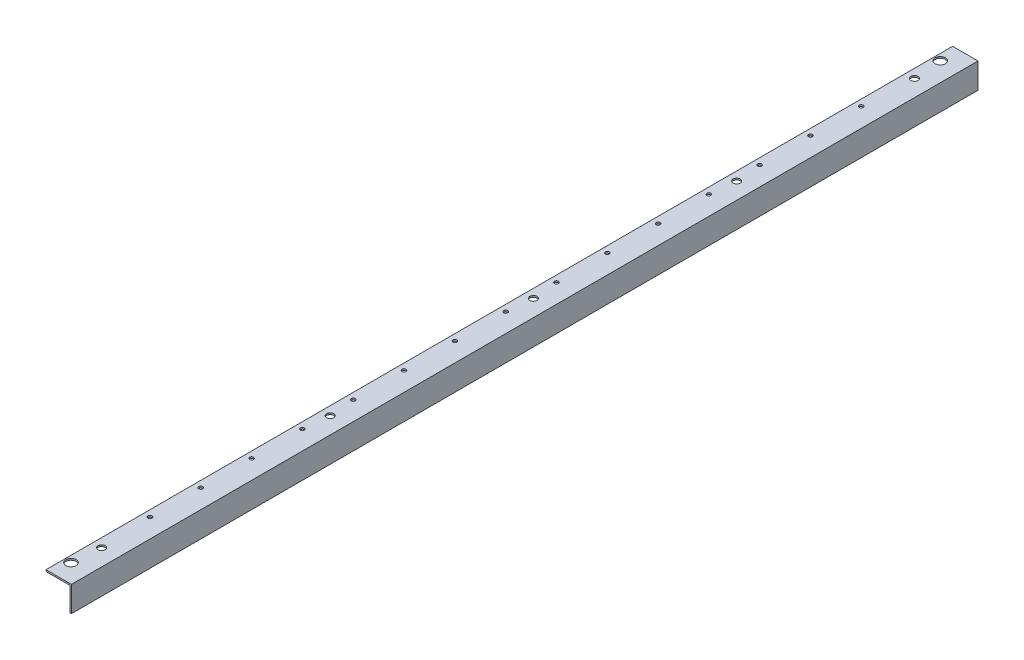
ISO-10303-21;
HEADER;
FILE_DESCRIPTION(('STEP AP214'),'2;1');
FILE_NAME('part.step','',(''),(''),'','','');
FILE_SCHEMA(('AUTOMOTIVE_DESIGN { 1 0 10303 214 1 1 1 1 }'));
ENDSEC;
DATA;
#1=APPLICATION_CONTEXT('core data for automotive mechanical design processes');
#2=APPLICATION_PROTOCOL_DEFINITION('international standard','automotive_design',2000,#1);
#3=PRODUCT_CONTEXT('',#1,'mechanical');
#4=PRODUCT('Part','Part','',(#3));
#5=PRODUCT_RELATED_PRODUCT_CATEGORY('part','',(#4));
#6=PRODUCT_DEFINITION_FORMATION('','',#4);
#7=PRODUCT_DEFINITION_CONTEXT('part definition',#1,'design');
#8=PRODUCT_DEFINITION('design','',#6,#7);
#9=PRODUCT_DEFINITION_SHAPE('','',#8);
#10=(LENGTH_UNIT() NAMED_UNIT(*) SI_UNIT(.MILLI.,.METRE.));
#11=(NAMED_UNIT(*) PLANE_ANGLE_UNIT() SI_UNIT($,.RADIAN.));
#12=(NAMED_UNIT(*) SI_UNIT($,.STERADIAN.) SOLID_ANGLE_UNIT());
#13=UNCERTAINTY_MEASURE_WITH_UNIT(LENGTH_MEASURE(1.E-05),#10,'distance_accuracy_value','');
#14=(GEOMETRIC_REPRESENTATION_CONTEXT(3) GLOBAL_UNCERTAINTY_ASSIGNED_CONTEXT((#13)) GLOBAL_UNIT_ASSIGNED_CONTEXT((#10,
#11,#12)) REPRESENTATION_CONTEXT('',''));
#15=CARTESIAN_POINT('',(0.,0.,0.));
#16=DIRECTION('',(0.,0.,1.));
#17=DIRECTION('',(1.,0.,0.));
#18=AXIS2_PLACEMENT_3D('',#15,#16,#17);
#19=CARTESIAN_POINT('',(0.,-50.8,1812.925));
#20=DIRECTION('',(-1.,0.,0.));
#21=DIRECTION('',(0.,0.,1.));
#22=AXIS2_PLACEMENT_3D('',#19,#20,#21);
#23=PLANE('',#22);
#24=DIRECTION('',(0.,1.,0.));
#25=VECTOR('',#24,1.);
#26=CARTESIAN_POINT('',(0.,-50.8,0.));
#27=LINE('',#26,#25);
#28=CARTESIAN_POINT('',(0.,-50.8,0.));
#29=VERTEX_POINT('',#28);
#30=CARTESIAN_POINT('',(0.,0.,0.));
#31=VERTEX_POINT('',#30);
#32=EDGE_CURVE('E118',#29,#31,#27,.T.);
#33=ORIENTED_EDGE('',*,*,#32,.T.);
#34=DIRECTION('',(0.,0.,-1.));
#35=VECTOR('',#34,1.);
#36=CARTESIAN_POINT('',(0.,0.,1812.925));
#37=LINE('',#36,#35);
#38=CARTESIAN_POINT('',(0.,0.,1812.925));
#39=VERTEX_POINT('',#38);
#40=EDGE_CURVE('E11',#39,#31,#37,.T.);
#41=ORIENTED_EDGE('',*,*,#40,.F.);
#42=DIRECTION('',(0.,1.,0.));
#43=VECTOR('',#42,1.);
#44=CARTESIAN_POINT('',(0.,-50.8,1812.925));
#45=LINE('',#44,#43);
#46=CARTESIAN_POINT('',(0.,-50.8,1812.925));
#47=VERTEX_POINT('',#46);
#48=EDGE_CURVE('E129',#47,#39,#45,.T.);
#49=ORIENTED_EDGE('',*,*,#48,.F.);
#50=DIRECTION('',(0.,0.,-1.));
#51=VECTOR('',#50,1.);
#52=CARTESIAN_POINT('',(0.,-50.8,1812.925));
#53=LINE('',#52,#51);
#54=EDGE_CURVE('E114',#47,#29,#53,.T.);
#55=ORIENTED_EDGE('',*,*,#54,.T.);
#56=EDGE_LOOP('',(#33,#41,#49,#55));
#57=FACE_BOUND('',#56,.T.);
#58=ADVANCED_FACE('F32',(#57),#23,.F.);
#59=CARTESIAN_POINT('',(0.,0.,1812.925));
#60=DIRECTION('',(0.,-1.,0.));
#61=DIRECTION('',(0.,0.,-1.));
#62=AXIS2_PLACEMENT_3D('',#59,#60,#61);
#63=PLANE('',#62);
#64=CARTESIAN_POINT('',(-38.1,0.,296.8625));
#65=DIRECTION('',(0.,1.,0.));
#66=DIRECTION('',(0.,0.,1.));
#67=AXIS2_PLACEMENT_3D('',#64,#65,#66);
#68=CIRCLE('',#67,3.96874999999999);
#69=CARTESIAN_POINT('',(-38.1,0.,300.83125));
#70=VERTEX_POINT('',#69);
#71=EDGE_CURVE('E165',#70,#70,#68,.T.);
#72=ORIENTED_EDGE('',*,*,#71,.F.);
#73=EDGE_LOOP('',(#72));
#74=FACE_BOUND('',#73,.T.);
#75=CARTESIAN_POINT('',(-38.1,0.,398.4625));
#76=DIRECTION('',(0.,1.,0.));
#77=DIRECTION('',(0.,0.,1.));
#78=AXIS2_PLACEMENT_3D('',#75,#76,#77);
#79=CIRCLE('',#78,3.96874999999999);
#80=CARTESIAN_POINT('',(-38.1,0.,402.43125));
#81=VERTEX_POINT('',#80);
#82=EDGE_CURVE('E578',#81,#81,#79,.T.);
#83=ORIENTED_EDGE('',*,*,#82,.F.);
#84=EDGE_LOOP('',(#83));
#85=FACE_BOUND('',#84,.T.);
#86=CARTESIAN_POINT('',(-38.1,0.,500.0625));
#87=DIRECTION('',(0.,1.,0.));
#88=DIRECTION('',(0.,0.,1.));
#89=AXIS2_PLACEMENT_3D('',#86,#87,#88);
#90=CIRCLE('',#89,3.96874999999999);
#91=CARTESIAN_POINT('',(-38.1,0.,504.03125));
#92=VERTEX_POINT('',#91);
#93=EDGE_CURVE('E581',#92,#92,#90,.T.);
#94=ORIENTED_EDGE('',*,*,#93,.F.);
#95=EDGE_LOOP('',(#94));
#96=FACE_BOUND('',#95,.T.);
#97=CARTESIAN_POINT('',(-38.1,0.,601.6625));
#98=DIRECTION('',(0.,1.,0.));
#99=DIRECTION('',(0.,0.,1.));
#100=AXIS2_PLACEMENT_3D('',#97,#98,#99);
#101=CIRCLE('',#100,3.96874999999999);
#102=CARTESIAN_POINT('',(-38.1,0.,605.63125));
#103=VERTEX_POINT('',#102);
#104=EDGE_CURVE('E586',#103,#103,#101,.T.);
#105=ORIENTED_EDGE('',*,*,#104,.F.);
#106=EDGE_LOOP('',(#105));
#107=FACE_BOUND('',#106,.T.);
#108=CARTESIAN_POINT('',(-38.1,0.,703.2625));
#109=DIRECTION('',(0.,1.,0.));
#110=DIRECTION('',(0.,0.,1.));
#111=AXIS2_PLACEMENT_3D('',#108,#109,#110);
#112=CIRCLE('',#111,3.96874999999999);
#113=CARTESIAN_POINT('',(-38.1,0.,707.23125));
#114=VERTEX_POINT('',#113);
#115=EDGE_CURVE('E589',#114,#114,#112,.T.);
#116=ORIENTED_EDGE('',*,*,#115,.F.);
#117=EDGE_LOOP('',(#116));
#118=FACE_BOUND('',#117,.T.);
#119=CARTESIAN_POINT('',(-38.1,0.,804.8625));
#120=DIRECTION('',(0.,1.,0.));
#121=DIRECTION('',(0.,0.,1.));
#122=AXIS2_PLACEMENT_3D('',#119,#120,#121);
#123=CIRCLE('',#122,3.96874999999999);
#124=CARTESIAN_POINT('',(-38.1,0.,808.83125));
#125=VERTEX_POINT('',#124);
#126=EDGE_CURVE('E592',#125,#125,#123,.T.);
#127=ORIENTED_EDGE('',*,*,#126,.F.);
#128=EDGE_LOOP('',(#127));
#129=FACE_BOUND('',#128,.T.);
#130=CARTESIAN_POINT('',(-38.1,0.,906.4625));
#131=DIRECTION('',(0.,1.,0.));
#132=DIRECTION('',(0.,0.,1.));
#133=AXIS2_PLACEMENT_3D('',#130,#131,#132);
#134=CIRCLE('',#133,3.96874999999999);
#135=CARTESIAN_POINT('',(-38.1,0.,910.43125));
#136=VERTEX_POINT('',#135);
#137=EDGE_CURVE('E595',#136,#136,#134,.T.);
#138=ORIENTED_EDGE('',*,*,#137,.F.);
#139=EDGE_LOOP('',(#138));
#140=FACE_BOUND('',#139,.T.);
#141=CARTESIAN_POINT('',(-38.1,0.,1008.0625));
#142=DIRECTION('',(0.,1.,0.));
#143=DIRECTION('',(0.,0.,1.));
#144=AXIS2_PLACEMENT_3D('',#141,#142,#143);
#145=CIRCLE('',#144,3.96874999999999);
#146=CARTESIAN_POINT('',(-38.1,0.,1012.03125));
#147=VERTEX_POINT('',#146);
#148=EDGE_CURVE('E598',#147,#147,#145,.T.);
#149=ORIENTED_EDGE('',*,*,#148,.F.);
#150=EDGE_LOOP('',(#149));
#151=FACE_BOUND('',#150,.T.);
#152=CARTESIAN_POINT('',(-38.1,0.,1109.6625));
#153=DIRECTION('',(0.,1.,0.));
#154=DIRECTION('',(0.,0.,1.));
#155=AXIS2_PLACEMENT_3D('',#152,#153,#154);
#156=CIRCLE('',#155,3.96874999999999);
#157=CARTESIAN_POINT('',(-38.1,0.,1113.63125));
#158=VERTEX_POINT('',#157);
#159=EDGE_CURVE('E601',#158,#158,#156,.T.);
#160=ORIENTED_EDGE('',*,*,#159,.F.);
#161=EDGE_LOOP('',(#160));
#162=FACE_BOUND('',#161,.T.);
#163=CARTESIAN_POINT('',(-38.1,0.,1211.2625));
#164=DIRECTION('',(0.,1.,0.));
#165=DIRECTION('',(0.,0.,1.));
#166=AXIS2_PLACEMENT_3D('',#163,#164,#165);
#167=CIRCLE('',#166,3.96874999999999);
#168=CARTESIAN_POINT('',(-38.1,0.,1215.23125));
#169=VERTEX_POINT('',#168);
#170=EDGE_CURVE('E604',#169,#169,#167,.T.);
#171=ORIENTED_EDGE('',*,*,#170,.F.);
#172=EDGE_LOOP('',(#171));
#173=FACE_BOUND('',#172,.T.);
#174=CARTESIAN_POINT('',(-38.1,0.,1312.8625));
#175=DIRECTION('',(0.,1.,0.));
#176=DIRECTION('',(0.,0.,1.));
#177=AXIS2_PLACEMENT_3D('',#174,#175,#176);
#178=CIRCLE('',#177,3.96874999999999);
#179=CARTESIAN_POINT('',(-38.1,0.,1316.83125));
#180=VERTEX_POINT('',#179);
#181=EDGE_CURVE('E607',#180,#180,#178,.T.);
#182=ORIENTED_EDGE('',*,*,#181,.F.);
#183=EDGE_LOOP('',(#182));
#184=FACE_BOUND('',#183,.T.);
#185=CARTESIAN_POINT('',(-38.1,0.,1414.4625));
#186=DIRECTION('',(0.,1.,0.));
#187=DIRECTION('',(0.,0.,1.));
#188=AXIS2_PLACEMENT_3D('',#185,#186,#187);
#189=CIRCLE('',#188,3.96874999999999);
#190=CARTESIAN_POINT('',(-38.1,0.,1418.43125));
#191=VERTEX_POINT('',#190);
#192=EDGE_CURVE('E610',#191,#191,#189,.T.);
#193=ORIENTED_EDGE('',*,*,#192,.F.);
#194=EDGE_LOOP('',(#193));
#195=FACE_BOUND('',#194,.T.);
#196=CARTESIAN_POINT('',(-38.1,0.,1516.0625));
#197=DIRECTION('',(0.,1.,0.));
#198=DIRECTION('',(0.,0.,1.));
#199=AXIS2_PLACEMENT_3D('',#196,#197,#198);
#200=CIRCLE('',#199,3.96874999999999);
#201=CARTESIAN_POINT('',(-38.1,0.,1520.03125));
#202=VERTEX_POINT('',#201);
#203=EDGE_CURVE('E612',#202,#202,#200,.T.);
#204=ORIENTED_EDGE('',*,*,#203,.F.);
#205=EDGE_LOOP('',(#204));
#206=FACE_BOUND('',#205,.T.);
#207=CARTESIAN_POINT('',(-38.1,0.,1617.6625));
#208=DIRECTION('',(0.,1.,0.));
#209=DIRECTION('',(0.,0.,1.));
#210=AXIS2_PLACEMENT_3D('',#207,#208,#209);
#211=CIRCLE('',#210,3.96874999999999);
#212=CARTESIAN_POINT('',(-38.1,0.,1621.63125));
#213=VERTEX_POINT('',#212);
#214=EDGE_CURVE('E210',#213,#213,#211,.T.);
#215=ORIENTED_EDGE('',*,*,#214,.F.);
#216=EDGE_LOOP('',(#215));
#217=FACE_BOUND('',#216,.T.);
#218=CARTESIAN_POINT('',(-38.1,0.,195.2625));
#219=DIRECTION('',(0.,1.,0.));
#220=DIRECTION('',(0.,0.,1.));
#221=AXIS2_PLACEMENT_3D('',#218,#219,#220);
#222=CIRCLE('',#221,3.96874999999999);
#223=CARTESIAN_POINT('',(-38.1,0.,199.23125));
#224=VERTEX_POINT('',#223);
#225=EDGE_CURVE('E160',#224,#224,#222,.T.);
#226=ORIENTED_EDGE('',*,*,#225,.F.);
#227=EDGE_LOOP('',(#226));
#228=FACE_BOUND('',#227,.T.);
#229=CARTESIAN_POINT('',(-38.1,0.,37.3062500000001));
#230=DIRECTION('',(0.,1.,0.));
#231=DIRECTION('',(0.,0.,1.));
#232=AXIS2_PLACEMENT_3D('',#229,#230,#231);
#233=CIRCLE('',#232,10.31875);
#234=CARTESIAN_POINT('',(-38.1,0.,47.6250000000001));
#235=VERTEX_POINT('',#234);
#236=EDGE_CURVE('E139',#235,#235,#233,.T.);
#237=ORIENTED_EDGE('',*,*,#236,.F.);
#238=EDGE_LOOP('',(#237));
#239=FACE_BOUND('',#238,.T.);
#240=CARTESIAN_POINT('',(-33.3375,0.,1719.2625));
#241=DIRECTION('',(0.,1.,0.));
#242=DIRECTION('',(0.,0.,1.));
#243=AXIS2_PLACEMENT_3D('',#240,#241,#242);
#244=CIRCLE('',#243,7.14375000000008);
#245=CARTESIAN_POINT('',(-33.3375,0.,1726.40625));
#246=VERTEX_POINT('',#245);
#247=EDGE_CURVE('E159',#246,#246,#244,.T.);
#248=ORIENTED_EDGE('',*,*,#247,.F.);
#249=EDGE_LOOP('',(#248));
#250=FACE_BOUND('',#249,.T.);
#251=CARTESIAN_POINT('',(-33.3375,0.,1262.0625));
#252=DIRECTION('',(0.,1.,0.));
#253=DIRECTION('',(0.,0.,1.));
#254=AXIS2_PLACEMENT_3D('',#251,#252,#253);
#255=CIRCLE('',#254,7.14375);
#256=CARTESIAN_POINT('',(-33.3375,0.,1269.20625));
#257=VERTEX_POINT('',#256);
#258=EDGE_CURVE('E215',#257,#257,#255,.T.);
#259=ORIENTED_EDGE('',*,*,#258,.F.);
#260=EDGE_LOOP('',(#259));
#261=FACE_BOUND('',#260,.T.);
#262=CARTESIAN_POINT('',(-38.0999999999999,0.,1775.61875));
#263=DIRECTION('',(0.,1.,0.));
#264=DIRECTION('',(0.,0.,1.));
#265=AXIS2_PLACEMENT_3D('',#262,#263,#264);
#266=CIRCLE('',#265,10.31875);
#267=CARTESIAN_POINT('',(-38.0999999999999,0.,1785.9375));
#268=VERTEX_POINT('',#267);
#269=EDGE_CURVE('E214',#268,#268,#266,.T.);
#270=ORIENTED_EDGE('',*,*,#269,.F.);
#271=EDGE_LOOP('',(#270));
#272=FACE_BOUND('',#271,.T.);
#273=CARTESIAN_POINT('',(-33.3375,0.,93.6625));
#274=DIRECTION('',(0.,1.,0.));
#275=DIRECTION('',(0.,0.,1.));
#276=AXIS2_PLACEMENT_3D('',#273,#274,#275);
#277=CIRCLE('',#276,7.14375);
#278=CARTESIAN_POINT('',(-33.3375,0.,100.80625));
#279=VERTEX_POINT('',#278);
#280=EDGE_CURVE('E224',#279,#279,#277,.T.);
#281=ORIENTED_EDGE('',*,*,#280,.F.);
#282=EDGE_LOOP('',(#281));
#283=FACE_BOUND('',#282,.T.);
#284=CARTESIAN_POINT('',(-33.3375,0.,449.2625));
#285=DIRECTION('',(0.,1.,0.));
#286=DIRECTION('',(0.,0.,1.));
#287=AXIS2_PLACEMENT_3D('',#284,#285,#286);
#288=CIRCLE('',#287,7.14375000000002);
#289=CARTESIAN_POINT('',(-33.3375,0.,456.40625));
#290=VERTEX_POINT('',#289);
#291=EDGE_CURVE('E221',#290,#290,#288,.T.);
#292=ORIENTED_EDGE('',*,*,#291,.F.);
#293=EDGE_LOOP('',(#292));
#294=FACE_BOUND('',#293,.T.);
#295=CARTESIAN_POINT('',(-33.3375,0.,855.6625));
#296=DIRECTION('',(0.,1.,0.));
#297=DIRECTION('',(0.,0.,1.));
#298=AXIS2_PLACEMENT_3D('',#295,#296,#297);
#299=CIRCLE('',#298,7.14374999999997);
#300=CARTESIAN_POINT('',(-33.3375,0.,862.80625));
#301=VERTEX_POINT('',#300);
#302=EDGE_CURVE('E218',#301,#301,#299,.T.);
#303=ORIENTED_EDGE('',*,*,#302,.F.);
#304=EDGE_LOOP('',(#303));
#305=FACE_BOUND('',#304,.T.);
#306=DIRECTION('',(-1.,0.,0.));
#307=VECTOR('',#306,1.);
#308=CARTESIAN_POINT('',(0.,0.,0.));
#309=LINE('',#308,#307);
#310=CARTESIAN_POINT('',(-50.8,0.,0.));
#311=VERTEX_POINT('',#310);
#312=EDGE_CURVE('E121',#31,#311,#309,.T.);
#313=ORIENTED_EDGE('',*,*,#312,.T.);
#314=DIRECTION('',(0.,0.,-1.));
#315=VECTOR('',#314,1.);
#316=CARTESIAN_POINT('',(-50.8,0.,1812.925));
#317=LINE('',#316,#315);
#318=CARTESIAN_POINT('',(-50.8,0.,1812.925));
#319=VERTEX_POINT('',#318);
#320=EDGE_CURVE('E41',#319,#311,#317,.T.);
#321=ORIENTED_EDGE('',*,*,#320,.F.);
#322=DIRECTION('',(-1.,0.,0.));
#323=VECTOR('',#322,1.);
#324=CARTESIAN_POINT('',(0.,0.,1812.925));
#325=LINE('',#324,#323);
#326=EDGE_CURVE('E87',#39,#319,#325,.T.);
#327=ORIENTED_EDGE('',*,*,#326,.F.);
#328=ORIENTED_EDGE('',*,*,#40,.T.);
#329=EDGE_LOOP('',(#313,#321,#327,#328));
#330=FACE_BOUND('',#329,.T.);
#331=ADVANCED_FACE('F234',(#74,#85,#96,#107,#118,#129,#140,#151,#162,#173,#184,#195,#206,#217,
#228,#239,#250,#261,#272,#283,#294,#305,#330),#63,.F.);
#332=CARTESIAN_POINT('',(-50.8,0.,1812.925));
#333=DIRECTION('',(1.,0.,0.));
#334=DIRECTION('',(0.,0.,-1.));
#335=AXIS2_PLACEMENT_3D('',#332,#333,#334);
#336=PLANE('',#335);
#337=DIRECTION('',(0.,-1.,0.));
#338=VECTOR('',#337,1.);
#339=CARTESIAN_POINT('',(-50.8,0.,0.));
#340=LINE('',#339,#338);
#341=CARTESIAN_POINT('',(-50.8,-3.17500000000001,0.));
#342=VERTEX_POINT('',#341);
#343=EDGE_CURVE('E124',#311,#342,#340,.T.);
#344=ORIENTED_EDGE('',*,*,#343,.T.);
#345=DIRECTION('',(0.,0.,-1.));
#346=VECTOR('',#345,1.);
#347=CARTESIAN_POINT('',(-50.8,-3.17500000000001,1812.925));
#348=LINE('',#347,#346);
#349=CARTESIAN_POINT('',(-50.8,-3.17500000000001,1812.925));
#350=VERTEX_POINT('',#349);
#351=EDGE_CURVE('E109',#350,#342,#348,.T.);
#352=ORIENTED_EDGE('',*,*,#351,.F.);
#353=DIRECTION('',(0.,-1.,0.));
#354=VECTOR('',#353,1.);
#355=CARTESIAN_POINT('',(-50.8,0.,1812.925));
#356=LINE('',#355,#354);
#357=EDGE_CURVE('E100',#319,#350,#356,.T.);
#358=ORIENTED_EDGE('',*,*,#357,.F.);
#359=ORIENTED_EDGE('',*,*,#320,.T.);
#360=EDGE_LOOP('',(#344,#352,#358,#359));
#361=FACE_BOUND('',#360,.T.);
#362=ADVANCED_FACE('F237',(#361),#336,.F.);
#363=CARTESIAN_POINT('',(-50.8,-3.17500000000001,1812.925));
#364=DIRECTION('',(0.,1.,0.));
#365=DIRECTION('',(0.,0.,1.));
#366=AXIS2_PLACEMENT_3D('',#363,#364,#365);
#367=PLANE('',#366);
#368=CARTESIAN_POINT('',(-38.1,-3.175,296.8625));
#369=DIRECTION('',(0.,1.,0.));
#370=DIRECTION('',(0.,0.,1.));
#371=AXIS2_PLACEMENT_3D('',#368,#369,#370);
#372=CIRCLE('',#371,3.96874999999999);
#373=CARTESIAN_POINT('',(-38.1,-3.175,300.83125));
#374=VERTEX_POINT('',#373);
#375=EDGE_CURVE('E35',#374,#374,#372,.T.);
#376=ORIENTED_EDGE('',*,*,#375,.T.);
#377=EDGE_LOOP('',(#376));
#378=FACE_BOUND('',#377,.T.);
#379=CARTESIAN_POINT('',(-38.1,-3.175,398.4625));
#380=DIRECTION('',(0.,1.,0.));
#381=DIRECTION('',(0.,0.,1.));
#382=AXIS2_PLACEMENT_3D('',#379,#380,#381);
#383=CIRCLE('',#382,3.96874999999999);
#384=CARTESIAN_POINT('',(-38.1,-3.175,402.43125));
#385=VERTEX_POINT('',#384);
#386=EDGE_CURVE('E197',#385,#385,#383,.T.);
#387=ORIENTED_EDGE('',*,*,#386,.T.);
#388=EDGE_LOOP('',(#387));
#389=FACE_BOUND('',#388,.T.);
#390=CARTESIAN_POINT('',(-38.1,-3.175,500.0625));
#391=DIRECTION('',(0.,1.,0.));
#392=DIRECTION('',(0.,0.,1.));
#393=AXIS2_PLACEMENT_3D('',#390,#391,#392);
#394=CIRCLE('',#393,3.96874999999999);
#395=CARTESIAN_POINT('',(-38.1,-3.175,504.03125));
#396=VERTEX_POINT('',#395);
#397=EDGE_CURVE('E195',#396,#396,#394,.T.);
#398=ORIENTED_EDGE('',*,*,#397,.T.);
#399=EDGE_LOOP('',(#398));
#400=FACE_BOUND('',#399,.T.);
#401=CARTESIAN_POINT('',(-38.1,-3.175,601.6625));
#402=DIRECTION('',(0.,1.,0.));
#403=DIRECTION('',(0.,0.,1.));
#404=AXIS2_PLACEMENT_3D('',#401,#402,#403);
#405=CIRCLE('',#404,3.96874999999999);
#406=CARTESIAN_POINT('',(-38.1,-3.175,605.63125));
#407=VERTEX_POINT('',#406);
#408=EDGE_CURVE('E192',#407,#407,#405,.T.);
#409=ORIENTED_EDGE('',*,*,#408,.T.);
#410=EDGE_LOOP('',(#409));
#411=FACE_BOUND('',#410,.T.);
#412=CARTESIAN_POINT('',(-38.1,-3.175,703.2625));
#413=DIRECTION('',(0.,1.,0.));
#414=DIRECTION('',(0.,0.,1.));
#415=AXIS2_PLACEMENT_3D('',#412,#413,#414);
#416=CIRCLE('',#415,3.96874999999999);
#417=CARTESIAN_POINT('',(-38.1,-3.175,707.23125));
#418=VERTEX_POINT('',#417);
#419=EDGE_CURVE('E189',#418,#418,#416,.T.);
#420=ORIENTED_EDGE('',*,*,#419,.T.);
#421=EDGE_LOOP('',(#420));
#422=FACE_BOUND('',#421,.T.);
#423=CARTESIAN_POINT('',(-38.1,-3.175,804.8625));
#424=DIRECTION('',(0.,1.,0.));
#425=DIRECTION('',(0.,0.,1.));
#426=AXIS2_PLACEMENT_3D('',#423,#424,#425);
#427=CIRCLE('',#426,3.96874999999999);
#428=CARTESIAN_POINT('',(-38.1,-3.175,808.83125));
#429=VERTEX_POINT('',#428);
#430=EDGE_CURVE('E186',#429,#429,#427,.T.);
#431=ORIENTED_EDGE('',*,*,#430,.T.);
#432=EDGE_LOOP('',(#431));
#433=FACE_BOUND('',#432,.T.);
#434=CARTESIAN_POINT('',(-38.1,-3.175,906.4625));
#435=DIRECTION('',(0.,1.,0.));
#436=DIRECTION('',(0.,0.,1.));
#437=AXIS2_PLACEMENT_3D('',#434,#435,#436);
#438=CIRCLE('',#437,3.96874999999999);
#439=CARTESIAN_POINT('',(-38.1,-3.175,910.43125));
#440=VERTEX_POINT('',#439);
#441=EDGE_CURVE('E183',#440,#440,#438,.T.);
#442=ORIENTED_EDGE('',*,*,#441,.T.);
#443=EDGE_LOOP('',(#442));
#444=FACE_BOUND('',#443,.T.);
#445=CARTESIAN_POINT('',(-38.1,-3.175,1008.0625));
#446=DIRECTION('',(0.,1.,0.));
#447=DIRECTION('',(0.,0.,1.));
#448=AXIS2_PLACEMENT_3D('',#445,#446,#447);
#449=CIRCLE('',#448,3.96874999999999);
#450=CARTESIAN_POINT('',(-38.1,-3.175,1012.03125));
#451=VERTEX_POINT('',#450);
#452=EDGE_CURVE('E180',#451,#451,#449,.T.);
#453=ORIENTED_EDGE('',*,*,#452,.T.);
#454=EDGE_LOOP('',(#453));
#455=FACE_BOUND('',#454,.T.);
#456=CARTESIAN_POINT('',(-38.1,-3.175,1109.6625));
#457=DIRECTION('',(0.,1.,0.));
#458=DIRECTION('',(0.,0.,1.));
#459=AXIS2_PLACEMENT_3D('',#456,#457,#458);
#460=CIRCLE('',#459,3.96874999999999);
#461=CARTESIAN_POINT('',(-38.1,-3.175,1113.63125));
#462=VERTEX_POINT('',#461);
#463=EDGE_CURVE('E177',#462,#462,#460,.T.);
#464=ORIENTED_EDGE('',*,*,#463,.T.);
#465=EDGE_LOOP('',(#464));
#466=FACE_BOUND('',#465,.T.);
#467=CARTESIAN_POINT('',(-38.1,-3.175,1211.2625));
#468=DIRECTION('',(0.,1.,0.));
#469=DIRECTION('',(0.,0.,1.));
#470=AXIS2_PLACEMENT_3D('',#467,#468,#469);
#471=CIRCLE('',#470,3.96874999999999);
#472=CARTESIAN_POINT('',(-38.1,-3.175,1215.23125));
#473=VERTEX_POINT('',#472);
#474=EDGE_CURVE('E174',#473,#473,#471,.T.);
#475=ORIENTED_EDGE('',*,*,#474,.T.);
#476=EDGE_LOOP('',(#475));
#477=FACE_BOUND('',#476,.T.);
#478=CARTESIAN_POINT('',(-38.1,-3.175,1312.8625));
#479=DIRECTION('',(0.,1.,0.));
#480=DIRECTION('',(0.,0.,1.));
#481=AXIS2_PLACEMENT_3D('',#478,#479,#480);
#482=CIRCLE('',#481,3.96874999999999);
#483=CARTESIAN_POINT('',(-38.1,-3.175,1316.83125));
#484=VERTEX_POINT('',#483);
#485=EDGE_CURVE('E171',#484,#484,#482,.T.);
#486=ORIENTED_EDGE('',*,*,#485,.T.);
#487=EDGE_LOOP('',(#486));
#488=FACE_BOUND('',#487,.T.);
#489=CARTESIAN_POINT('',(-38.1,-3.175,1414.4625));
#490=DIRECTION('',(0.,1.,0.));
#491=DIRECTION('',(0.,0.,1.));
#492=AXIS2_PLACEMENT_3D('',#489,#490,#491);
#493=CIRCLE('',#492,3.96874999999999);
#494=CARTESIAN_POINT('',(-38.1,-3.175,1418.43125));
#495=VERTEX_POINT('',#494);
#496=EDGE_CURVE('E168',#495,#495,#493,.T.);
#497=ORIENTED_EDGE('',*,*,#496,.T.);
#498=EDGE_LOOP('',(#497));
#499=FACE_BOUND('',#498,.T.);
#500=CARTESIAN_POINT('',(-38.1,-3.175,1516.0625));
#501=DIRECTION('',(0.,1.,0.));
#502=DIRECTION('',(0.,0.,1.));
#503=AXIS2_PLACEMENT_3D('',#500,#501,#502);
#504=CIRCLE('',#503,3.96874999999999);
#505=CARTESIAN_POINT('',(-38.1,-3.175,1520.03125));
#506=VERTEX_POINT('',#505);
#507=EDGE_CURVE('E164',#506,#506,#504,.T.);
#508=ORIENTED_EDGE('',*,*,#507,.T.);
#509=EDGE_LOOP('',(#508));
#510=FACE_BOUND('',#509,.T.);
#511=CARTESIAN_POINT('',(-38.1,-3.175,1617.6625));
#512=DIRECTION('',(0.,1.,0.));
#513=DIRECTION('',(0.,0.,1.));
#514=AXIS2_PLACEMENT_3D('',#511,#512,#513);
#515=CIRCLE('',#514,3.96874999999999);
#516=CARTESIAN_POINT('',(-38.1,-3.175,1621.63125));
#517=VERTEX_POINT('',#516);
#518=EDGE_CURVE('E161',#517,#517,#515,.T.);
#519=ORIENTED_EDGE('',*,*,#518,.T.);
#520=EDGE_LOOP('',(#519));
#521=FACE_BOUND('',#520,.T.);
#522=CARTESIAN_POINT('',(-38.1,-3.175,195.2625));
#523=DIRECTION('',(0.,1.,0.));
#524=DIRECTION('',(0.,0.,1.));
#525=AXIS2_PLACEMENT_3D('',#522,#523,#524);
#526=CIRCLE('',#525,3.96874999999999);
#527=CARTESIAN_POINT('',(-38.1,-3.175,199.23125));
#528=VERTEX_POINT('',#527);
#529=EDGE_CURVE('E156',#528,#528,#526,.T.);
#530=ORIENTED_EDGE('',*,*,#529,.T.);
#531=EDGE_LOOP('',(#530));
#532=FACE_BOUND('',#531,.T.);
#533=CARTESIAN_POINT('',(-38.1,-3.175,37.3062500000001));
#534=DIRECTION('',(0.,1.,0.));
#535=DIRECTION('',(0.,0.,1.));
#536=AXIS2_PLACEMENT_3D('',#533,#534,#535);
#537=CIRCLE('',#536,10.31875);
#538=CARTESIAN_POINT('',(-38.1,-3.175,47.6250000000001));
#539=VERTEX_POINT('',#538);
#540=EDGE_CURVE('E122',#539,#539,#537,.T.);
#541=ORIENTED_EDGE('',*,*,#540,.T.);
#542=EDGE_LOOP('',(#541));
#543=FACE_BOUND('',#542,.T.);
#544=CARTESIAN_POINT('',(-33.3375,-3.175,1719.2625));
#545=DIRECTION('',(0.,1.,0.));
#546=DIRECTION('',(0.,0.,1.));
#547=AXIS2_PLACEMENT_3D('',#544,#545,#546);
#548=CIRCLE('',#547,7.14375000000008);
#549=CARTESIAN_POINT('',(-33.3375,-3.175,1726.40625));
#550=VERTEX_POINT('',#549);
#551=EDGE_CURVE('E151',#550,#550,#548,.T.);
#552=ORIENTED_EDGE('',*,*,#551,.T.);
#553=EDGE_LOOP('',(#552));
#554=FACE_BOUND('',#553,.T.);
#555=CARTESIAN_POINT('',(-33.3375,-3.175,1262.0625));
#556=DIRECTION('',(0.,1.,0.));
#557=DIRECTION('',(0.,0.,1.));
#558=AXIS2_PLACEMENT_3D('',#555,#556,#557);
#559=CIRCLE('',#558,7.14375);
#560=CARTESIAN_POINT('',(-33.3375,-3.175,1269.20625));
#561=VERTEX_POINT('',#560);
#562=EDGE_CURVE('E148',#561,#561,#559,.T.);
#563=ORIENTED_EDGE('',*,*,#562,.T.);
#564=EDGE_LOOP('',(#563));
#565=FACE_BOUND('',#564,.T.);
#566=CARTESIAN_POINT('',(-38.0999999999999,-3.175,1775.61875));
#567=DIRECTION('',(0.,1.,0.));
#568=DIRECTION('',(0.,0.,1.));
#569=AXIS2_PLACEMENT_3D('',#566,#567,#568);
#570=CIRCLE('',#569,10.31875);
#571=CARTESIAN_POINT('',(-38.0999999999999,-3.175,1785.9375));
#572=VERTEX_POINT('',#571);
#573=EDGE_CURVE('E145',#572,#572,#570,.T.);
#574=ORIENTED_EDGE('',*,*,#573,.T.);
#575=EDGE_LOOP('',(#574));
#576=FACE_BOUND('',#575,.T.);
#577=CARTESIAN_POINT('',(-33.3375,-3.175,93.6625));
#578=DIRECTION('',(0.,1.,0.));
#579=DIRECTION('',(0.,0.,1.));
#580=AXIS2_PLACEMENT_3D('',#577,#578,#579);
#581=CIRCLE('',#580,7.14375);
#582=CARTESIAN_POINT('',(-33.3375,-3.175,100.80625));
#583=VERTEX_POINT('',#582);
#584=EDGE_CURVE('E142',#583,#583,#581,.T.);
#585=ORIENTED_EDGE('',*,*,#584,.T.);
#586=EDGE_LOOP('',(#585));
#587=FACE_BOUND('',#586,.T.);
#588=CARTESIAN_POINT('',(-33.3375,-3.175,449.2625));
#589=DIRECTION('',(0.,1.,0.));
#590=DIRECTION('',(0.,0.,1.));
#591=AXIS2_PLACEMENT_3D('',#588,#589,#590);
#592=CIRCLE('',#591,7.14375000000002);
#593=CARTESIAN_POINT('',(-33.3375,-3.175,456.40625));
#594=VERTEX_POINT('',#593);
#595=EDGE_CURVE('E138',#594,#594,#592,.T.);
#596=ORIENTED_EDGE('',*,*,#595,.T.);
#597=EDGE_LOOP('',(#596));
#598=FACE_BOUND('',#597,.T.);
#599=CARTESIAN_POINT('',(-33.3375,-3.175,855.6625));
#600=DIRECTION('',(0.,1.,0.));
#601=DIRECTION('',(0.,0.,1.));
#602=AXIS2_PLACEMENT_3D('',#599,#600,#601);
#603=CIRCLE('',#602,7.14374999999997);
#604=CARTESIAN_POINT('',(-33.3375,-3.175,862.80625));
#605=VERTEX_POINT('',#604);
#606=EDGE_CURVE('E135',#605,#605,#603,.T.);
#607=ORIENTED_EDGE('',*,*,#606,.T.);
#608=EDGE_LOOP('',(#607));
#609=FACE_BOUND('',#608,.T.);
#610=DIRECTION('',(1.,0.,0.));
#611=VECTOR('',#610,1.);
#612=CARTESIAN_POINT('',(-50.8,-3.17500000000001,0.));
#613=LINE('',#612,#611);
#614=CARTESIAN_POINT('',(-3.17500000000001,-3.17500000000001,0.));
#615=VERTEX_POINT('',#614);
#616=EDGE_CURVE('E108',#342,#615,#613,.T.);
#617=ORIENTED_EDGE('',*,*,#616,.T.);
#618=DIRECTION('',(0.,0.,-1.));
#619=VECTOR('',#618,1.);
#620=CARTESIAN_POINT('',(-3.17500000000001,-3.17500000000001,1812.925));
#621=LINE('',#620,#619);
#622=CARTESIAN_POINT('',(-3.17500000000001,-3.17500000000001,1812.925));
#623=VERTEX_POINT('',#622);
#624=EDGE_CURVE('E105',#623,#615,#621,.T.);
#625=ORIENTED_EDGE('',*,*,#624,.F.);
#626=DIRECTION('',(1.,0.,0.));
#627=VECTOR('',#626,1.);
#628=CARTESIAN_POINT('',(-50.8,-3.17500000000001,1812.925));
#629=LINE('',#628,#627);
#630=EDGE_CURVE('E94',#350,#623,#629,.T.);
#631=ORIENTED_EDGE('',*,*,#630,.F.);
#632=ORIENTED_EDGE('',*,*,#351,.T.);
#633=EDGE_LOOP('',(#617,#625,#631,#632));
#634=FACE_BOUND('',#633,.T.);
#635=ADVANCED_FACE('F106',(#378,#389,#400,#411,#422,#433,#444,#455,#466,#477,#488,#499,#510,
#521,#532,#543,#554,#565,#576,#587,#598,#609,#634),#367,.F.);
#636=CARTESIAN_POINT('',(-3.17500000000001,-3.17500000000001,1812.925));
#637=DIRECTION('',(1.,0.,0.));
#638=DIRECTION('',(0.,1.,0.));
#639=AXIS2_PLACEMENT_3D('',#636,#637,#638);
#640=PLANE('',#639);
#641=DIRECTION('',(0.,-1.,0.));
#642=VECTOR('',#641,1.);
#643=CARTESIAN_POINT('',(-3.17500000000001,-3.17500000000001,0.));
#644=LINE('',#643,#642);
#645=CARTESIAN_POINT('',(-3.175,-50.8,0.));
#646=VERTEX_POINT('',#645);
#647=EDGE_CURVE('E73',#615,#646,#644,.T.);
#648=ORIENTED_EDGE('',*,*,#647,.T.);
#649=DIRECTION('',(0.,0.,-1.));
#650=VECTOR('',#649,1.);
#651=CARTESIAN_POINT('',(-3.175,-50.8,1812.925));
#652=LINE('',#651,#650);
#653=CARTESIAN_POINT('',(-3.175,-50.8,1812.925));
#654=VERTEX_POINT('',#653);
#655=EDGE_CURVE('E110',#654,#646,#652,.T.);
#656=ORIENTED_EDGE('',*,*,#655,.F.);
#657=DIRECTION('',(0.,-1.,0.));
#658=VECTOR('',#657,1.);
#659=CARTESIAN_POINT('',(-3.17500000000001,-3.17500000000001,1812.925));
#660=LINE('',#659,#658);
#661=EDGE_CURVE('E98',#623,#654,#660,.T.);
#662=ORIENTED_EDGE('',*,*,#661,.F.);
#663=ORIENTED_EDGE('',*,*,#624,.T.);
#664=EDGE_LOOP('',(#648,#656,#662,#663));
#665=FACE_BOUND('',#664,.T.);
#666=ADVANCED_FACE('F112',(#665),#640,.F.);
#667=CARTESIAN_POINT('',(-3.175,-50.8,1812.925));
#668=DIRECTION('',(0.,1.,0.));
#669=DIRECTION('',(0.,0.,1.));
#670=AXIS2_PLACEMENT_3D('',#667,#668,#669);
#671=PLANE('',#670);
#672=DIRECTION('',(1.,0.,0.));
#673=VECTOR('',#672,1.);
#674=CARTESIAN_POINT('',(-3.175,-50.8,0.));
#675=LINE('',#674,#673);
#676=EDGE_CURVE('E79',#646,#29,#675,.T.);
#677=ORIENTED_EDGE('',*,*,#676,.T.);
#678=ORIENTED_EDGE('',*,*,#54,.F.);
#679=DIRECTION('',(1.,0.,0.));
#680=VECTOR('',#679,1.);
#681=CARTESIAN_POINT('',(-3.175,-50.8,1812.925));
#682=LINE('',#681,#680);
#683=EDGE_CURVE('E50',#654,#47,#682,.T.);
#684=ORIENTED_EDGE('',*,*,#683,.F.);
#685=ORIENTED_EDGE('',*,*,#655,.T.);
#686=EDGE_LOOP('',(#677,#678,#684,#685));
#687=FACE_BOUND('',#686,.T.);
#688=ADVANCED_FACE('F242',(#687),#671,.F.);
#689=CARTESIAN_POINT('',(0.,0.,1812.925));
#690=DIRECTION('',(0.,0.,1.));
#691=DIRECTION('',(1.,0.,0.));
#692=AXIS2_PLACEMENT_3D('',#689,#690,#691);
#693=PLANE('',#692);
#694=ORIENTED_EDGE('',*,*,#48,.T.);
#695=ORIENTED_EDGE('',*,*,#326,.T.);
#696=ORIENTED_EDGE('',*,*,#357,.T.);
#697=ORIENTED_EDGE('',*,*,#630,.T.);
#698=ORIENTED_EDGE('',*,*,#661,.T.);
#699=ORIENTED_EDGE('',*,*,#683,.T.);
#700=EDGE_LOOP('',(#694,#695,#696,#697,#698,#699));
#701=FACE_BOUND('',#700,.T.);
#702=ADVANCED_FACE('F96',(#701),#693,.T.);
#703=CARTESIAN_POINT('',(0.,0.,0.));
#704=DIRECTION('',(0.,0.,1.));
#705=DIRECTION('',(1.,0.,0.));
#706=AXIS2_PLACEMENT_3D('',#703,#704,#705);
#707=PLANE('',#706);
#708=ORIENTED_EDGE('',*,*,#32,.F.);
#709=ORIENTED_EDGE('',*,*,#676,.F.);
#710=ORIENTED_EDGE('',*,*,#647,.F.);
#711=ORIENTED_EDGE('',*,*,#616,.F.);
#712=ORIENTED_EDGE('',*,*,#343,.F.);
#713=ORIENTED_EDGE('',*,*,#312,.F.);
#714=EDGE_LOOP('',(#708,#709,#710,#711,#712,#713));
#715=FACE_BOUND('',#714,.T.);
#716=ADVANCED_FACE('F240',(#715),#707,.F.);
#717=CARTESIAN_POINT('',(-33.3375,-50.8,855.6625));
#718=DIRECTION('',(0.,1.,0.));
#719=DIRECTION('',(0.,0.,1.));
#720=AXIS2_PLACEMENT_3D('',#717,#718,#719);
#721=CYLINDRICAL_SURFACE('',#720,7.14374999999997);
#722=ORIENTED_EDGE('',*,*,#302,.T.);
#723=EDGE_LOOP('',(#722));
#724=FACE_BOUND('',#723,.T.);
#725=ORIENTED_EDGE('',*,*,#606,.F.);
#726=EDGE_LOOP('',(#725));
#727=FACE_BOUND('',#726,.T.);
#728=ADVANCED_FACE('F308',(#724,#727),#721,.F.);
#729=CARTESIAN_POINT('',(-33.3375,-50.8,449.2625));
#730=DIRECTION('',(0.,1.,0.));
#731=DIRECTION('',(0.,0.,1.));
#732=AXIS2_PLACEMENT_3D('',#729,#730,#731);
#733=CYLINDRICAL_SURFACE('',#732,7.14375000000002);
#734=ORIENTED_EDGE('',*,*,#291,.T.);
#735=EDGE_LOOP('',(#734));
#736=FACE_BOUND('',#735,.T.);
#737=ORIENTED_EDGE('',*,*,#595,.F.);
#738=EDGE_LOOP('',(#737));
#739=FACE_BOUND('',#738,.T.);
#740=ADVANCED_FACE('F310',(#736,#739),#733,.F.);
#741=CARTESIAN_POINT('',(-33.3375,-50.8,93.6625));
#742=DIRECTION('',(0.,1.,0.));
#743=DIRECTION('',(0.,0.,1.));
#744=AXIS2_PLACEMENT_3D('',#741,#742,#743);
#745=CYLINDRICAL_SURFACE('',#744,7.14375);
#746=ORIENTED_EDGE('',*,*,#280,.T.);
#747=EDGE_LOOP('',(#746));
#748=FACE_BOUND('',#747,.T.);
#749=ORIENTED_EDGE('',*,*,#584,.F.);
#750=EDGE_LOOP('',(#749));
#751=FACE_BOUND('',#750,.T.);
#752=ADVANCED_FACE('F317',(#748,#751),#745,.F.);
#753=CARTESIAN_POINT('',(-38.0999999999999,-50.8,1775.61875));
#754=DIRECTION('',(0.,1.,0.));
#755=DIRECTION('',(0.,0.,1.));
#756=AXIS2_PLACEMENT_3D('',#753,#754,#755);
#757=CYLINDRICAL_SURFACE('',#756,10.31875);
#758=ORIENTED_EDGE('',*,*,#269,.T.);
#759=EDGE_LOOP('',(#758));
#760=FACE_BOUND('',#759,.T.);
#761=ORIENTED_EDGE('',*,*,#573,.F.);
#762=EDGE_LOOP('',(#761));
#763=FACE_BOUND('',#762,.T.);
#764=ADVANCED_FACE('F322',(#760,#763),#757,.F.);
#765=CARTESIAN_POINT('',(-33.3375,-50.8,1262.0625));
#766=DIRECTION('',(0.,1.,0.));
#767=DIRECTION('',(0.,0.,1.));
#768=AXIS2_PLACEMENT_3D('',#765,#766,#767);
#769=CYLINDRICAL_SURFACE('',#768,7.14375);
#770=ORIENTED_EDGE('',*,*,#258,.T.);
#771=EDGE_LOOP('',(#770));
#772=FACE_BOUND('',#771,.T.);
#773=ORIENTED_EDGE('',*,*,#562,.F.);
#774=EDGE_LOOP('',(#773));
#775=FACE_BOUND('',#774,.T.);
#776=ADVANCED_FACE('F325',(#772,#775),#769,.F.);
#777=CARTESIAN_POINT('',(-33.3375,-50.8,1719.2625));
#778=DIRECTION('',(0.,1.,0.));
#779=DIRECTION('',(0.,0.,1.));
#780=AXIS2_PLACEMENT_3D('',#777,#778,#779);
#781=CYLINDRICAL_SURFACE('',#780,7.14375000000008);
#782=ORIENTED_EDGE('',*,*,#247,.T.);
#783=EDGE_LOOP('',(#782));
#784=FACE_BOUND('',#783,.T.);
#785=ORIENTED_EDGE('',*,*,#551,.F.);
#786=EDGE_LOOP('',(#785));
#787=FACE_BOUND('',#786,.T.);
#788=ADVANCED_FACE('F351',(#784,#787),#781,.F.);
#789=CARTESIAN_POINT('',(-38.1,-50.8,37.3062500000001));
#790=DIRECTION('',(0.,1.,0.));
#791=DIRECTION('',(0.,0.,1.));
#792=AXIS2_PLACEMENT_3D('',#789,#790,#791);
#793=CYLINDRICAL_SURFACE('',#792,10.31875);
#794=ORIENTED_EDGE('',*,*,#236,.T.);
#795=EDGE_LOOP('',(#794));
#796=FACE_BOUND('',#795,.T.);
#797=ORIENTED_EDGE('',*,*,#540,.F.);
#798=EDGE_LOOP('',(#797));
#799=FACE_BOUND('',#798,.T.);
#800=ADVANCED_FACE('F359',(#796,#799),#793,.F.);
#801=CARTESIAN_POINT('',(-38.1,-44.45,195.2625));
#802=DIRECTION('',(0.,1.,0.));
#803=DIRECTION('',(0.,0.,1.));
#804=AXIS2_PLACEMENT_3D('',#801,#802,#803);
#805=CYLINDRICAL_SURFACE('',#804,3.96874999999999);
#806=ORIENTED_EDGE('',*,*,#225,.T.);
#807=EDGE_LOOP('',(#806));
#808=FACE_BOUND('',#807,.T.);
#809=ORIENTED_EDGE('',*,*,#529,.F.);
#810=EDGE_LOOP('',(#809));
#811=FACE_BOUND('',#810,.T.);
#812=ADVANCED_FACE('F366',(#808,#811),#805,.F.);
#813=CARTESIAN_POINT('',(-38.1,-44.45,1617.6625));
#814=DIRECTION('',(0.,1.,0.));
#815=DIRECTION('',(0.,0.,1.));
#816=AXIS2_PLACEMENT_3D('',#813,#814,#815);
#817=CYLINDRICAL_SURFACE('',#816,3.96874999999999);
#818=ORIENTED_EDGE('',*,*,#214,.T.);
#819=EDGE_LOOP('',(#818));
#820=FACE_BOUND('',#819,.T.);
#821=ORIENTED_EDGE('',*,*,#518,.F.);
#822=EDGE_LOOP('',(#821));
#823=FACE_BOUND('',#822,.T.);
#824=ADVANCED_FACE('F374',(#820,#823),#817,.F.);
#825=CARTESIAN_POINT('',(-38.1,-44.45,1516.0625));
#826=DIRECTION('',(0.,1.,0.));
#827=DIRECTION('',(0.,0.,1.));
#828=AXIS2_PLACEMENT_3D('',#825,#826,#827);
#829=CYLINDRICAL_SURFACE('',#828,3.96874999999999);
#830=ORIENTED_EDGE('',*,*,#203,.T.);
#831=EDGE_LOOP('',(#830));
#832=FACE_BOUND('',#831,.T.);
#833=ORIENTED_EDGE('',*,*,#507,.F.);
#834=EDGE_LOOP('',(#833));
#835=FACE_BOUND('',#834,.T.);
#836=ADVANCED_FACE('F381',(#832,#835),#829,.F.);
#837=CARTESIAN_POINT('',(-38.1,-44.45,1414.4625));
#838=DIRECTION('',(0.,1.,0.));
#839=DIRECTION('',(0.,0.,1.));
#840=AXIS2_PLACEMENT_3D('',#837,#838,#839);
#841=CYLINDRICAL_SURFACE('',#840,3.96874999999999);
#842=ORIENTED_EDGE('',*,*,#192,.T.);
#843=EDGE_LOOP('',(#842));
#844=FACE_BOUND('',#843,.T.);
#845=ORIENTED_EDGE('',*,*,#496,.F.);
#846=EDGE_LOOP('',(#845));
#847=FACE_BOUND('',#846,.T.);
#848=ADVANCED_FACE('F389',(#844,#847),#841,.F.);
#849=CARTESIAN_POINT('',(-38.1,-44.45,1312.8625));
#850=DIRECTION('',(0.,1.,0.));
#851=DIRECTION('',(0.,0.,1.));
#852=AXIS2_PLACEMENT_3D('',#849,#850,#851);
#853=CYLINDRICAL_SURFACE('',#852,3.96874999999999);
#854=ORIENTED_EDGE('',*,*,#181,.T.);
#855=EDGE_LOOP('',(#854));
#856=FACE_BOUND('',#855,.T.);
#857=ORIENTED_EDGE('',*,*,#485,.F.);
#858=EDGE_LOOP('',(#857));
#859=FACE_BOUND('',#858,.T.);
#860=ADVANCED_FACE('F397',(#856,#859),#853,.F.);
#861=CARTESIAN_POINT('',(-38.1,-44.45,1211.2625));
#862=DIRECTION('',(0.,1.,0.));
#863=DIRECTION('',(0.,0.,1.));
#864=AXIS2_PLACEMENT_3D('',#861,#862,#863);
#865=CYLINDRICAL_SURFACE('',#864,3.96874999999999);
#866=ORIENTED_EDGE('',*,*,#170,.T.);
#867=EDGE_LOOP('',(#866));
#868=FACE_BOUND('',#867,.T.);
#869=ORIENTED_EDGE('',*,*,#474,.F.);
#870=EDGE_LOOP('',(#869));
#871=FACE_BOUND('',#870,.T.);
#872=ADVANCED_FACE('F405',(#868,#871),#865,.F.);
#873=CARTESIAN_POINT('',(-38.1,-44.45,1109.6625));
#874=DIRECTION('',(0.,1.,0.));
#875=DIRECTION('',(0.,0.,1.));
#876=AXIS2_PLACEMENT_3D('',#873,#874,#875);
#877=CYLINDRICAL_SURFACE('',#876,3.96874999999999);
#878=ORIENTED_EDGE('',*,*,#159,.T.);
#879=EDGE_LOOP('',(#878));
#880=FACE_BOUND('',#879,.T.);
#881=ORIENTED_EDGE('',*,*,#463,.F.);
#882=EDGE_LOOP('',(#881));
#883=FACE_BOUND('',#882,.T.);
#884=ADVANCED_FACE('F413',(#880,#883),#877,.F.);
#885=CARTESIAN_POINT('',(-38.1,-44.45,1008.0625));
#886=DIRECTION('',(0.,1.,0.));
#887=DIRECTION('',(0.,0.,1.));
#888=AXIS2_PLACEMENT_3D('',#885,#886,#887);
#889=CYLINDRICAL_SURFACE('',#888,3.96874999999999);
#890=ORIENTED_EDGE('',*,*,#148,.T.);
#891=EDGE_LOOP('',(#890));
#892=FACE_BOUND('',#891,.T.);
#893=ORIENTED_EDGE('',*,*,#452,.F.);
#894=EDGE_LOOP('',(#893));
#895=FACE_BOUND('',#894,.T.);
#896=ADVANCED_FACE('F421',(#892,#895),#889,.F.);
#897=CARTESIAN_POINT('',(-38.1,-44.45,906.4625));
#898=DIRECTION('',(0.,1.,0.));
#899=DIRECTION('',(0.,0.,1.));
#900=AXIS2_PLACEMENT_3D('',#897,#898,#899);
#901=CYLINDRICAL_SURFACE('',#900,3.96874999999999);
#902=ORIENTED_EDGE('',*,*,#137,.T.);
#903=EDGE_LOOP('',(#902));
#904=FACE_BOUND('',#903,.T.);
#905=ORIENTED_EDGE('',*,*,#441,.F.);
#906=EDGE_LOOP('',(#905));
#907=FACE_BOUND('',#906,.T.);
#908=ADVANCED_FACE('F429',(#904,#907),#901,.F.);
#909=CARTESIAN_POINT('',(-38.1,-44.45,804.8625));
#910=DIRECTION('',(0.,1.,0.));
#911=DIRECTION('',(0.,0.,1.));
#912=AXIS2_PLACEMENT_3D('',#909,#910,#911);
#913=CYLINDRICAL_SURFACE('',#912,3.96874999999999);
#914=ORIENTED_EDGE('',*,*,#126,.T.);
#915=EDGE_LOOP('',(#914));
#916=FACE_BOUND('',#915,.T.);
#917=ORIENTED_EDGE('',*,*,#430,.F.);
#918=EDGE_LOOP('',(#917));
#919=FACE_BOUND('',#918,.T.);
#920=ADVANCED_FACE('F437',(#916,#919),#913,.F.);
#921=CARTESIAN_POINT('',(-38.1,-44.45,703.2625));
#922=DIRECTION('',(0.,1.,0.));
#923=DIRECTION('',(0.,0.,1.));
#924=AXIS2_PLACEMENT_3D('',#921,#922,#923);
#925=CYLINDRICAL_SURFACE('',#924,3.96874999999999);
#926=ORIENTED_EDGE('',*,*,#115,.T.);
#927=EDGE_LOOP('',(#926));
#928=FACE_BOUND('',#927,.T.);
#929=ORIENTED_EDGE('',*,*,#419,.F.);
#930=EDGE_LOOP('',(#929));
#931=FACE_BOUND('',#930,.T.);
#932=ADVANCED_FACE('F445',(#928,#931),#925,.F.);
#933=CARTESIAN_POINT('',(-38.1,-44.45,601.6625));
#934=DIRECTION('',(0.,1.,0.));
#935=DIRECTION('',(0.,0.,1.));
#936=AXIS2_PLACEMENT_3D('',#933,#934,#935);
#937=CYLINDRICAL_SURFACE('',#936,3.96874999999999);
#938=ORIENTED_EDGE('',*,*,#104,.T.);
#939=EDGE_LOOP('',(#938));
#940=FACE_BOUND('',#939,.T.);
#941=ORIENTED_EDGE('',*,*,#408,.F.);
#942=EDGE_LOOP('',(#941));
#943=FACE_BOUND('',#942,.T.);
#944=ADVANCED_FACE('F453',(#940,#943),#937,.F.);
#945=CARTESIAN_POINT('',(-38.1,-44.45,500.0625));
#946=DIRECTION('',(0.,1.,0.));
#947=DIRECTION('',(0.,0.,1.));
#948=AXIS2_PLACEMENT_3D('',#945,#946,#947);
#949=CYLINDRICAL_SURFACE('',#948,3.96874999999999);
#950=ORIENTED_EDGE('',*,*,#93,.T.);
#951=EDGE_LOOP('',(#950));
#952=FACE_BOUND('',#951,.T.);
#953=ORIENTED_EDGE('',*,*,#397,.F.);
#954=EDGE_LOOP('',(#953));
#955=FACE_BOUND('',#954,.T.);
#956=ADVANCED_FACE('F461',(#952,#955),#949,.F.);
#957=CARTESIAN_POINT('',(-38.1,-44.45,398.4625));
#958=DIRECTION('',(0.,1.,0.));
#959=DIRECTION('',(0.,0.,1.));
#960=AXIS2_PLACEMENT_3D('',#957,#958,#959);
#961=CYLINDRICAL_SURFACE('',#960,3.96874999999999);
#962=ORIENTED_EDGE('',*,*,#82,.T.);
#963=EDGE_LOOP('',(#962));
#964=FACE_BOUND('',#963,.T.);
#965=ORIENTED_EDGE('',*,*,#386,.F.);
#966=EDGE_LOOP('',(#965));
#967=FACE_BOUND('',#966,.T.);
#968=ADVANCED_FACE('F469',(#964,#967),#961,.F.);
#969=CARTESIAN_POINT('',(-38.1,-44.45,296.8625));
#970=DIRECTION('',(0.,1.,0.));
#971=DIRECTION('',(0.,0.,1.));
#972=AXIS2_PLACEMENT_3D('',#969,#970,#971);
#973=CYLINDRICAL_SURFACE('',#972,3.96874999999999);
#974=ORIENTED_EDGE('',*,*,#71,.T.);
#975=EDGE_LOOP('',(#974));
#976=FACE_BOUND('',#975,.T.);
#977=ORIENTED_EDGE('',*,*,#375,.F.);
#978=EDGE_LOOP('',(#977));
#979=FACE_BOUND('',#978,.T.);
#980=ADVANCED_FACE('F477',(#976,#979),#973,.F.);
#981=CLOSED_SHELL('',(#58,#331,#362,#635,#666,#688,#702,#716,#728,#740,#752,#764,#776,#788,#800,
#812,#824,#836,#848,#860,#872,#884,#896,#908,#920,#932,#944,#956,#968,#980));
#982=MANIFOLD_SOLID_BREP('B2',#981);
#983=ADVANCED_BREP_SHAPE_REPRESENTATION('',(#18,#982),#14);
#984=SHAPE_DEFINITION_REPRESENTATION(#9,#983);
ENDSEC;
END-ISO-10303-21;
